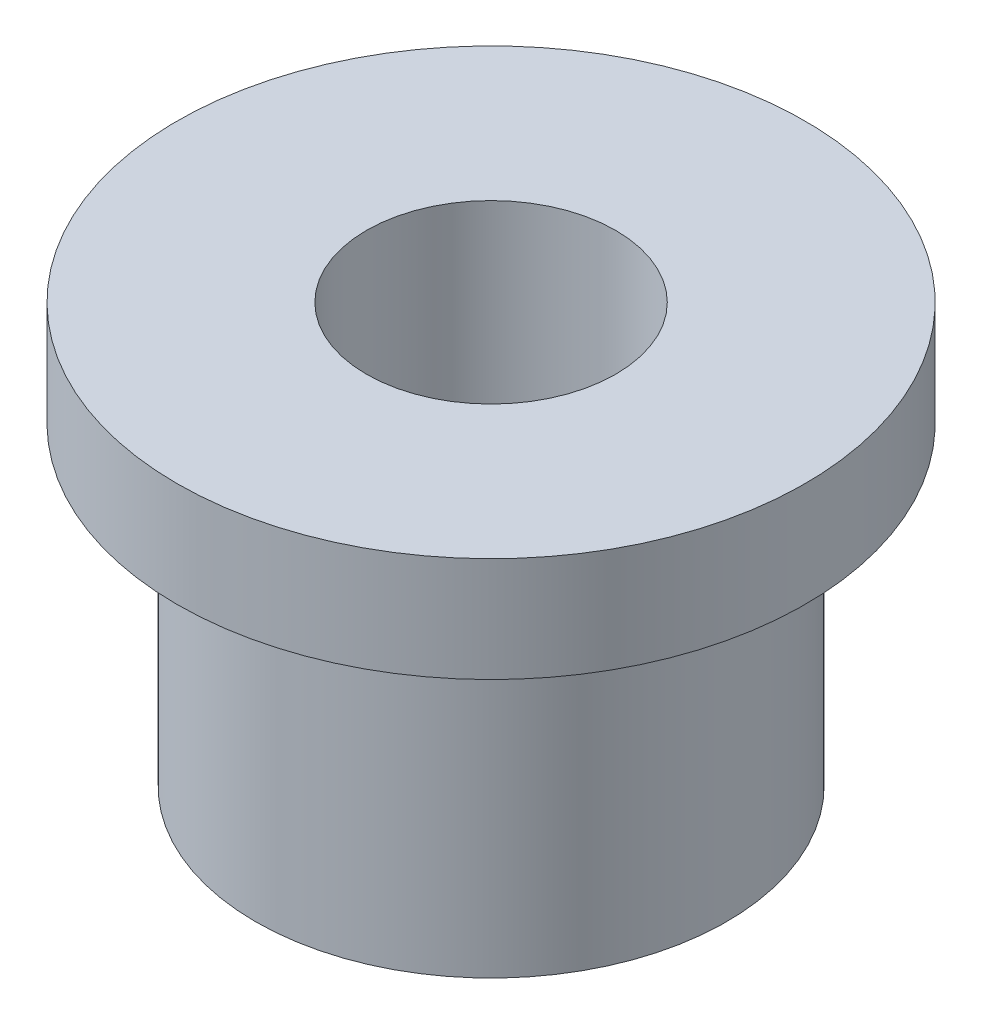
ISO-10303-21;
HEADER;
FILE_DESCRIPTION(('STEP AP214'),'2;1');
FILE_NAME('part.step','',(''),(''),'','','');
FILE_SCHEMA(('AUTOMOTIVE_DESIGN { 1 0 10303 214 1 1 1 1 }'));
ENDSEC;
DATA;
#1=APPLICATION_CONTEXT('core data for automotive mechanical design processes');
#2=APPLICATION_PROTOCOL_DEFINITION('international standard','automotive_design',2000,#1);
#3=PRODUCT_CONTEXT('',#1,'mechanical');
#4=PRODUCT('Part','Part','',(#3));
#5=PRODUCT_RELATED_PRODUCT_CATEGORY('part','',(#4));
#6=PRODUCT_DEFINITION_FORMATION('','',#4);
#7=PRODUCT_DEFINITION_CONTEXT('part definition',#1,'design');
#8=PRODUCT_DEFINITION('design','',#6,#7);
#9=PRODUCT_DEFINITION_SHAPE('','',#8);
#10=(LENGTH_UNIT() NAMED_UNIT(*) SI_UNIT(.MILLI.,.METRE.));
#11=(NAMED_UNIT(*) PLANE_ANGLE_UNIT() SI_UNIT($,.RADIAN.));
#12=(NAMED_UNIT(*) SI_UNIT($,.STERADIAN.) SOLID_ANGLE_UNIT());
#13=UNCERTAINTY_MEASURE_WITH_UNIT(LENGTH_MEASURE(1.E-05),#10,'distance_accuracy_value','');
#14=(GEOMETRIC_REPRESENTATION_CONTEXT(3) GLOBAL_UNCERTAINTY_ASSIGNED_CONTEXT((#13)) GLOBAL_UNIT_ASSIGNED_CONTEXT((#10,
#11,#12)) REPRESENTATION_CONTEXT('',''));
#15=CARTESIAN_POINT('',(0.,0.,0.));
#16=DIRECTION('',(0.,0.,1.));
#17=DIRECTION('',(1.,0.,0.));
#18=AXIS2_PLACEMENT_3D('',#15,#16,#17);
#19=CARTESIAN_POINT('',(0.,8.,0.));
#20=DIRECTION('',(0.,1.,0.));
#21=DIRECTION('',(0.,0.,1.));
#22=AXIS2_PLACEMENT_3D('',#19,#20,#21);
#23=CYLINDRICAL_SURFACE('',#22,4.7625);
#24=CARTESIAN_POINT('',(0.,-8.,0.));
#25=DIRECTION('',(0.,1.,0.));
#26=DIRECTION('',(0.,0.,1.));
#27=AXIS2_PLACEMENT_3D('',#24,#25,#26);
#28=CIRCLE('',#27,4.7625);
#29=CARTESIAN_POINT('',(0.,-8.,4.7625));
#30=VERTEX_POINT('',#29);
#31=EDGE_CURVE('E51',#30,#30,#28,.T.);
#32=ORIENTED_EDGE('',*,*,#31,.F.);
#33=EDGE_LOOP('',(#32));
#34=FACE_BOUND('',#33,.T.);
#35=CARTESIAN_POINT('',(0.,8.,0.));
#36=DIRECTION('',(0.,1.,0.));
#37=DIRECTION('',(0.,0.,1.));
#38=AXIS2_PLACEMENT_3D('',#35,#36,#37);
#39=CIRCLE('',#38,4.7625);
#40=CARTESIAN_POINT('',(0.,8.,4.7625));
#41=VERTEX_POINT('',#40);
#42=EDGE_CURVE('E10',#41,#41,#39,.T.);
#43=ORIENTED_EDGE('',*,*,#42,.T.);
#44=EDGE_LOOP('',(#43));
#45=FACE_BOUND('',#44,.T.);
#46=ADVANCED_FACE('F29',(#34,#45),#23,.F.);
#47=CARTESIAN_POINT('',(4.7625,8.,0.));
#48=DIRECTION('',(0.,-1.,0.));
#49=DIRECTION('',(0.,0.,-1.));
#50=AXIS2_PLACEMENT_3D('',#47,#48,#49);
#51=PLANE('',#50);
#52=ORIENTED_EDGE('',*,*,#42,.F.);
#53=EDGE_LOOP('',(#52));
#54=FACE_BOUND('',#53,.T.);
#55=CARTESIAN_POINT('',(0.,8.,0.));
#56=DIRECTION('',(0.,1.,0.));
#57=DIRECTION('',(0.,0.,1.));
#58=AXIS2_PLACEMENT_3D('',#55,#56,#57);
#59=CIRCLE('',#58,12.);
#60=CARTESIAN_POINT('',(0.,8.,12.));
#61=VERTEX_POINT('',#60);
#62=EDGE_CURVE('E35',#61,#61,#59,.T.);
#63=ORIENTED_EDGE('',*,*,#62,.T.);
#64=EDGE_LOOP('',(#63));
#65=FACE_BOUND('',#64,.T.);
#66=ADVANCED_FACE('F58',(#54,#65),#51,.F.);
#67=CARTESIAN_POINT('',(0.,8.,0.));
#68=DIRECTION('',(0.,1.,0.));
#69=DIRECTION('',(0.,0.,1.));
#70=AXIS2_PLACEMENT_3D('',#67,#68,#69);
#71=CYLINDRICAL_SURFACE('',#70,12.);
#72=ORIENTED_EDGE('',*,*,#62,.F.);
#73=EDGE_LOOP('',(#72));
#74=FACE_BOUND('',#73,.T.);
#75=CARTESIAN_POINT('',(0.,4.,0.));
#76=DIRECTION('',(0.,1.,0.));
#77=DIRECTION('',(0.,0.,1.));
#78=AXIS2_PLACEMENT_3D('',#75,#76,#77);
#79=CIRCLE('',#78,12.);
#80=CARTESIAN_POINT('',(0.,4.,12.));
#81=VERTEX_POINT('',#80);
#82=EDGE_CURVE('E39',#81,#81,#79,.T.);
#83=ORIENTED_EDGE('',*,*,#82,.T.);
#84=EDGE_LOOP('',(#83));
#85=FACE_BOUND('',#84,.T.);
#86=ADVANCED_FACE('F62',(#74,#85),#71,.T.);
#87=CARTESIAN_POINT('',(12.,4.,0.));
#88=DIRECTION('',(0.,1.,0.));
#89=DIRECTION('',(0.,0.,1.));
#90=AXIS2_PLACEMENT_3D('',#87,#88,#89);
#91=PLANE('',#90);
#92=ORIENTED_EDGE('',*,*,#82,.F.);
#93=EDGE_LOOP('',(#92));
#94=FACE_BOUND('',#93,.T.);
#95=CARTESIAN_POINT('',(0.,4.,0.));
#96=DIRECTION('',(0.,1.,0.));
#97=DIRECTION('',(0.,0.,1.));
#98=AXIS2_PLACEMENT_3D('',#95,#96,#97);
#99=CIRCLE('',#98,8.99999999999999);
#100=CARTESIAN_POINT('',(0.,4.,8.99999999999999));
#101=VERTEX_POINT('',#100);
#102=EDGE_CURVE('E43',#101,#101,#99,.T.);
#103=ORIENTED_EDGE('',*,*,#102,.T.);
#104=EDGE_LOOP('',(#103));
#105=FACE_BOUND('',#104,.T.);
#106=ADVANCED_FACE('F67',(#94,#105),#91,.F.);
#107=CARTESIAN_POINT('',(0.,8.,0.));
#108=DIRECTION('',(0.,1.,0.));
#109=DIRECTION('',(0.,0.,1.));
#110=AXIS2_PLACEMENT_3D('',#107,#108,#109);
#111=CYLINDRICAL_SURFACE('',#110,8.99999999999999);
#112=ORIENTED_EDGE('',*,*,#102,.F.);
#113=EDGE_LOOP('',(#112));
#114=FACE_BOUND('',#113,.T.);
#115=CARTESIAN_POINT('',(0.,-8.,0.));
#116=DIRECTION('',(0.,1.,0.));
#117=DIRECTION('',(0.,0.,1.));
#118=AXIS2_PLACEMENT_3D('',#115,#116,#117);
#119=CIRCLE('',#118,9.);
#120=CARTESIAN_POINT('',(0.,-8.,9.));
#121=VERTEX_POINT('',#120);
#122=EDGE_CURVE('E48',#121,#121,#119,.T.);
#123=ORIENTED_EDGE('',*,*,#122,.T.);
#124=EDGE_LOOP('',(#123));
#125=FACE_BOUND('',#124,.T.);
#126=ADVANCED_FACE('F73',(#114,#125),#111,.T.);
#127=CARTESIAN_POINT('',(9.,-8.,0.));
#128=DIRECTION('',(0.,1.,0.));
#129=DIRECTION('',(0.,0.,1.));
#130=AXIS2_PLACEMENT_3D('',#127,#128,#129);
#131=PLANE('',#130);
#132=ORIENTED_EDGE('',*,*,#122,.F.);
#133=EDGE_LOOP('',(#132));
#134=FACE_BOUND('',#133,.T.);
#135=ORIENTED_EDGE('',*,*,#31,.T.);
#136=EDGE_LOOP('',(#135));
#137=FACE_BOUND('',#136,.T.);
#138=ADVANCED_FACE('F55',(#134,#137),#131,.F.);
#139=CLOSED_SHELL('',(#46,#66,#86,#106,#126,#138));
#140=MANIFOLD_SOLID_BREP('B2',#139);
#141=ADVANCED_BREP_SHAPE_REPRESENTATION('',(#18,#140),#14);
#142=SHAPE_DEFINITION_REPRESENTATION(#9,#141);
ENDSEC;
END-ISO-10303-21;
